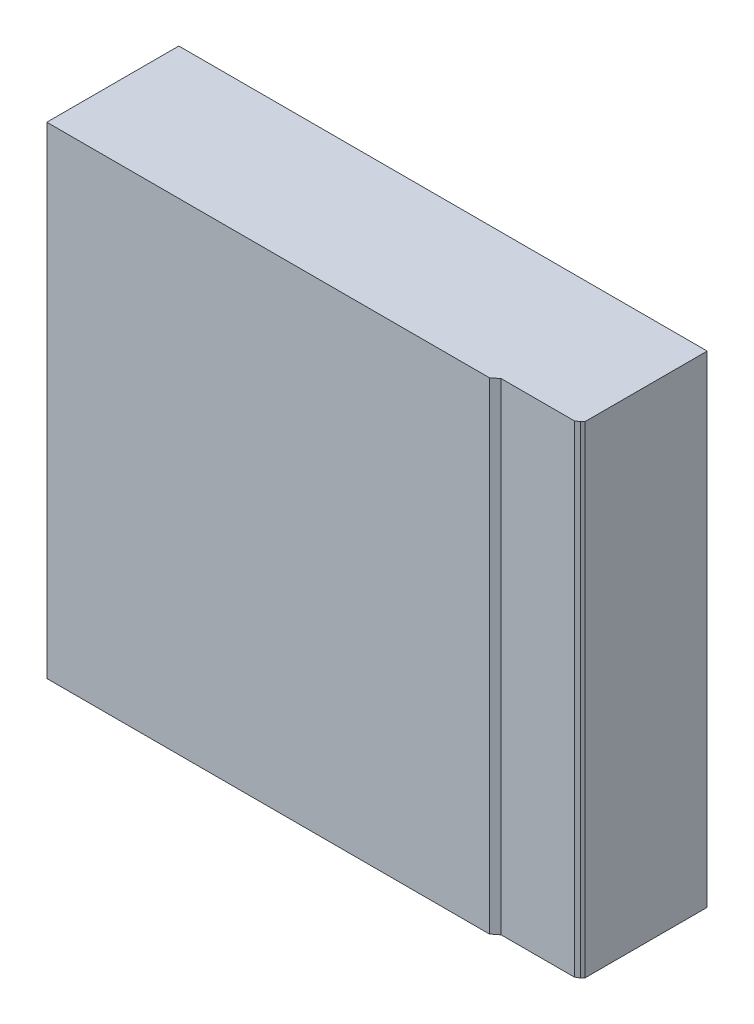
ISO-10303-21;
HEADER;
FILE_DESCRIPTION(('STEP AP214'),'2;1');
FILE_NAME('part.step','',(''),(''),'','','');
FILE_SCHEMA(('AUTOMOTIVE_DESIGN { 1 0 10303 214 1 1 1 1 }'));
ENDSEC;
DATA;
#1=APPLICATION_CONTEXT('core data for automotive mechanical design processes');
#2=APPLICATION_PROTOCOL_DEFINITION('international standard','automotive_design',2000,#1);
#3=PRODUCT_CONTEXT('',#1,'mechanical');
#4=PRODUCT('Part','Part','',(#3));
#5=PRODUCT_RELATED_PRODUCT_CATEGORY('part','',(#4));
#6=PRODUCT_DEFINITION_FORMATION('','',#4);
#7=PRODUCT_DEFINITION_CONTEXT('part definition',#1,'design');
#8=PRODUCT_DEFINITION('design','',#6,#7);
#9=PRODUCT_DEFINITION_SHAPE('','',#8);
#10=(LENGTH_UNIT() NAMED_UNIT(*) SI_UNIT(.MILLI.,.METRE.));
#11=(NAMED_UNIT(*) PLANE_ANGLE_UNIT() SI_UNIT($,.RADIAN.));
#12=(NAMED_UNIT(*) SI_UNIT($,.STERADIAN.) SOLID_ANGLE_UNIT());
#13=UNCERTAINTY_MEASURE_WITH_UNIT(LENGTH_MEASURE(1.E-05),#10,'distance_accuracy_value','');
#14=(GEOMETRIC_REPRESENTATION_CONTEXT(3) GLOBAL_UNCERTAINTY_ASSIGNED_CONTEXT((#13)) GLOBAL_UNIT_ASSIGNED_CONTEXT((#10,
#11,#12)) REPRESENTATION_CONTEXT('',''));
#15=CARTESIAN_POINT('',(0.,0.,0.));
#16=DIRECTION('',(0.,0.,1.));
#17=DIRECTION('',(1.,0.,0.));
#18=AXIS2_PLACEMENT_3D('',#15,#16,#17);
#19=CARTESIAN_POINT('',(0.,730.,-200.));
#20=DIRECTION('',(1.,0.,0.));
#21=DIRECTION('',(0.,0.,-1.));
#22=AXIS2_PLACEMENT_3D('',#19,#20,#21);
#23=PLANE('',#22);
#24=DIRECTION('',(0.,0.,1.));
#25=VECTOR('',#24,1.);
#26=CARTESIAN_POINT('',(0.,0.,-200.));
#27=LINE('',#26,#25);
#28=CARTESIAN_POINT('',(0.,0.,-200.));
#29=VERTEX_POINT('',#28);
#30=CARTESIAN_POINT('',(0.,0.,0.));
#31=VERTEX_POINT('',#30);
#32=EDGE_CURVE('E130',#29,#31,#27,.T.);
#33=ORIENTED_EDGE('',*,*,#32,.T.);
#34=DIRECTION('',(0.,-1.,0.));
#35=VECTOR('',#34,1.);
#36=CARTESIAN_POINT('',(0.,730.,0.));
#37=LINE('',#36,#35);
#38=CARTESIAN_POINT('',(0.,730.,0.));
#39=VERTEX_POINT('',#38);
#40=EDGE_CURVE('E11',#39,#31,#37,.T.);
#41=ORIENTED_EDGE('',*,*,#40,.F.);
#42=DIRECTION('',(0.,0.,1.));
#43=VECTOR('',#42,1.);
#44=CARTESIAN_POINT('',(0.,730.,-200.));
#45=LINE('',#44,#43);
#46=CARTESIAN_POINT('',(0.,730.,-200.));
#47=VERTEX_POINT('',#46);
#48=EDGE_CURVE('E144',#47,#39,#45,.T.);
#49=ORIENTED_EDGE('',*,*,#48,.F.);
#50=DIRECTION('',(0.,-1.,0.));
#51=VECTOR('',#50,1.);
#52=CARTESIAN_POINT('',(0.,730.,-200.));
#53=LINE('',#52,#51);
#54=EDGE_CURVE('E126',#47,#29,#53,.T.);
#55=ORIENTED_EDGE('',*,*,#54,.T.);
#56=EDGE_LOOP('',(#33,#41,#49,#55));
#57=FACE_BOUND('',#56,.T.);
#58=ADVANCED_FACE('F34',(#57),#23,.F.);
#59=CARTESIAN_POINT('',(0.,730.,0.));
#60=DIRECTION('',(0.,0.,-1.));
#61=DIRECTION('',(-1.,0.,0.));
#62=AXIS2_PLACEMENT_3D('',#59,#60,#61);
#63=PLANE('',#62);
#64=DIRECTION('',(1.,0.,0.));
#65=VECTOR('',#64,1.);
#66=CARTESIAN_POINT('',(0.,0.,0.));
#67=LINE('',#66,#65);
#68=CARTESIAN_POINT('',(670.632596603051,0.,0.));
#69=VERTEX_POINT('',#68);
#70=EDGE_CURVE('E133',#31,#69,#67,.T.);
#71=ORIENTED_EDGE('',*,*,#70,.T.);
#72=DIRECTION('',(0.,-1.,0.));
#73=VECTOR('',#72,1.);
#74=CARTESIAN_POINT('',(670.632596603051,730.,0.));
#75=LINE('',#74,#73);
#76=CARTESIAN_POINT('',(670.632596603051,730.,0.));
#77=VERTEX_POINT('',#76);
#78=EDGE_CURVE('E42',#77,#69,#75,.T.);
#79=ORIENTED_EDGE('',*,*,#78,.F.);
#80=DIRECTION('',(1.,0.,0.));
#81=VECTOR('',#80,1.);
#82=CARTESIAN_POINT('',(0.,730.,0.));
#83=LINE('',#82,#81);
#84=EDGE_CURVE('E93',#39,#77,#83,.T.);
#85=ORIENTED_EDGE('',*,*,#84,.F.);
#86=ORIENTED_EDGE('',*,*,#40,.T.);
#87=EDGE_LOOP('',(#71,#79,#85,#86));
#88=FACE_BOUND('',#87,.T.);
#89=ADVANCED_FACE('F179',(#88),#63,.F.);
#90=CARTESIAN_POINT('',(670.632596603051,730.,0.));
#91=DIRECTION('',(-0.61553350325039,0.,-0.788110719617683));
#92=DIRECTION('',(-0.788110719617683,0.,0.61553350325039));
#93=AXIS2_PLACEMENT_3D('',#90,#91,#92);
#94=PLANE('',#93);
#95=DIRECTION('',(0.788110719617683,0.,-0.61553350325039));
#96=VECTOR('',#95,1.);
#97=CARTESIAN_POINT('',(670.632596603051,0.,0.));
#98=LINE('',#97,#96);
#99=CARTESIAN_POINT('',(680.632596603051,0.,-7.81024147912859));
#100=VERTEX_POINT('',#99);
#101=EDGE_CURVE('E135',#69,#100,#98,.T.);
#102=ORIENTED_EDGE('',*,*,#101,.T.);
#103=DIRECTION('',(0.,-1.,0.));
#104=VECTOR('',#103,1.);
#105=CARTESIAN_POINT('',(680.632596603051,730.,-7.81024147912859));
#106=LINE('',#105,#104);
#107=CARTESIAN_POINT('',(680.632596603051,730.,-7.81024147912859));
#108=VERTEX_POINT('',#107);
#109=EDGE_CURVE('E151',#108,#100,#106,.T.);
#110=ORIENTED_EDGE('',*,*,#109,.F.);
#111=DIRECTION('',(0.788110719617683,0.,-0.61553350325039));
#112=VECTOR('',#111,1.);
#113=CARTESIAN_POINT('',(670.632596603051,730.,0.));
#114=LINE('',#113,#112);
#115=EDGE_CURVE('E159',#77,#108,#114,.T.);
#116=ORIENTED_EDGE('',*,*,#115,.F.);
#117=ORIENTED_EDGE('',*,*,#78,.T.);
#118=EDGE_LOOP('',(#102,#110,#116,#117));
#119=FACE_BOUND('',#118,.T.);
#120=ADVANCED_FACE('F157',(#119),#94,.F.);
#121=CARTESIAN_POINT('',(791.427044457084,730.,-7.81024147912859));
#122=DIRECTION('',(0.,0.,-1.));
#123=DIRECTION('',(-1.,0.,0.));
#124=AXIS2_PLACEMENT_3D('',#121,#122,#123);
#125=PLANE('',#124);
#126=DIRECTION('',(1.,0.,0.));
#127=VECTOR('',#126,1.);
#128=CARTESIAN_POINT('',(791.427044457084,0.,-7.81024147912859));
#129=LINE('',#128,#127);
#130=CARTESIAN_POINT('',(791.427044457084,0.,-7.81024147912859));
#131=VERTEX_POINT('',#130);
#132=EDGE_CURVE('E137',#100,#131,#129,.T.);
#133=ORIENTED_EDGE('',*,*,#132,.T.);
#134=DIRECTION('',(0.,-1.,0.));
#135=VECTOR('',#134,1.);
#136=CARTESIAN_POINT('',(791.427044457084,730.,-7.81024147912859));
#137=LINE('',#136,#135);
#138=CARTESIAN_POINT('',(791.427044457084,730.,-7.81024147912859));
#139=VERTEX_POINT('',#138);
#140=EDGE_CURVE('E148',#139,#131,#137,.T.);
#141=ORIENTED_EDGE('',*,*,#140,.F.);
#142=DIRECTION('',(1.,0.,0.));
#143=VECTOR('',#142,1.);
#144=CARTESIAN_POINT('',(791.427044457084,730.,-7.81024147912859));
#145=LINE('',#144,#143);
#146=EDGE_CURVE('E171',#108,#139,#145,.T.);
#147=ORIENTED_EDGE('',*,*,#146,.F.);
#148=ORIENTED_EDGE('',*,*,#109,.T.);
#149=EDGE_LOOP('',(#133,#141,#147,#148));
#150=FACE_BOUND('',#149,.T.);
#151=ADVANCED_FACE('F167',(#150),#125,.F.);
#152=CARTESIAN_POINT('',(791.427044457084,730.,-7.81024147912859));
#153=DIRECTION('',(-0.511532549187665,0.,-0.859263900743869));
#154=DIRECTION('',(-0.859263900743869,0.,0.511532549187665));
#155=AXIS2_PLACEMENT_3D('',#152,#153,#154);
#156=PLANE('',#155);
#157=DIRECTION('',(0.859263900743869,0.,-0.511532549187665));
#158=VECTOR('',#157,1.);
#159=CARTESIAN_POINT('',(791.427044457084,0.,-7.81024147912859));
#160=LINE('',#159,#158);
#161=CARTESIAN_POINT('',(797.288486629254,0.,-11.299644971642));
#162=VERTEX_POINT('',#161);
#163=EDGE_CURVE('E139',#131,#162,#160,.T.);
#164=ORIENTED_EDGE('',*,*,#163,.T.);
#165=DIRECTION('',(0.,-1.,0.));
#166=VECTOR('',#165,1.);
#167=CARTESIAN_POINT('',(797.288486629254,730.,-11.299644971642));
#168=LINE('',#167,#166);
#169=CARTESIAN_POINT('',(797.288486629254,730.,-11.299644971642));
#170=VERTEX_POINT('',#169);
#171=EDGE_CURVE('E121',#170,#162,#168,.T.);
#172=ORIENTED_EDGE('',*,*,#171,.F.);
#173=DIRECTION('',(0.859263900743869,0.,-0.511532549187665));
#174=VECTOR('',#173,1.);
#175=CARTESIAN_POINT('',(791.427044457084,730.,-7.81024147912859));
#176=LINE('',#175,#174);
#177=EDGE_CURVE('E112',#139,#170,#176,.T.);
#178=ORIENTED_EDGE('',*,*,#177,.F.);
#179=ORIENTED_EDGE('',*,*,#140,.T.);
#180=EDGE_LOOP('',(#164,#172,#178,#179));
#181=FACE_BOUND('',#180,.T.);
#182=ADVANCED_FACE('F170',(#181),#156,.F.);
#183=CARTESIAN_POINT('',(797.288486629254,730.,-11.299644971642));
#184=DIRECTION('',(-0.741917728526271,0.,-0.670490927677936));
#185=DIRECTION('',(-0.670490927677936,0.,0.741917728526271));
#186=AXIS2_PLACEMENT_3D('',#183,#184,#185);
#187=PLANE('',#186);
#188=DIRECTION('',(0.670490927677936,0.,-0.741917728526271));
#189=VECTOR('',#188,1.);
#190=CARTESIAN_POINT('',(797.288486629254,0.,-11.299644971642));
#191=LINE('',#190,#189);
#192=CARTESIAN_POINT('',(800.632596603051,0.,-15.));
#193=VERTEX_POINT('',#192);
#194=EDGE_CURVE('E120',#162,#193,#191,.T.);
#195=ORIENTED_EDGE('',*,*,#194,.T.);
#196=DIRECTION('',(0.,-1.,0.));
#197=VECTOR('',#196,1.);
#198=CARTESIAN_POINT('',(800.632596603051,730.,-15.));
#199=LINE('',#198,#197);
#200=CARTESIAN_POINT('',(800.632596603051,730.,-15.));
#201=VERTEX_POINT('',#200);
#202=EDGE_CURVE('E117',#201,#193,#199,.T.);
#203=ORIENTED_EDGE('',*,*,#202,.F.);
#204=DIRECTION('',(0.670490927677936,0.,-0.741917728526271));
#205=VECTOR('',#204,1.);
#206=CARTESIAN_POINT('',(797.288486629254,730.,-11.299644971642));
#207=LINE('',#206,#205);
#208=EDGE_CURVE('E106',#170,#201,#207,.T.);
#209=ORIENTED_EDGE('',*,*,#208,.F.);
#210=ORIENTED_EDGE('',*,*,#171,.T.);
#211=EDGE_LOOP('',(#195,#203,#209,#210));
#212=FACE_BOUND('',#211,.T.);
#213=ADVANCED_FACE('F118',(#212),#187,.F.);
#214=CARTESIAN_POINT('',(800.632596603051,730.,-200.));
#215=DIRECTION('',(-1.,0.,0.));
#216=DIRECTION('',(0.,0.,1.));
#217=AXIS2_PLACEMENT_3D('',#214,#215,#216);
#218=PLANE('',#217);
#219=DIRECTION('',(0.,0.,-1.));
#220=VECTOR('',#219,1.);
#221=CARTESIAN_POINT('',(800.632596603051,0.,-200.));
#222=LINE('',#221,#220);
#223=CARTESIAN_POINT('',(800.632596603051,0.,-200.));
#224=VERTEX_POINT('',#223);
#225=EDGE_CURVE('E79',#193,#224,#222,.T.);
#226=ORIENTED_EDGE('',*,*,#225,.T.);
#227=DIRECTION('',(0.,-1.,0.));
#228=VECTOR('',#227,1.);
#229=CARTESIAN_POINT('',(800.632596603051,730.,-200.));
#230=LINE('',#229,#228);
#231=CARTESIAN_POINT('',(800.632596603051,730.,-200.));
#232=VERTEX_POINT('',#231);
#233=EDGE_CURVE('E122',#232,#224,#230,.T.);
#234=ORIENTED_EDGE('',*,*,#233,.F.);
#235=DIRECTION('',(0.,0.,-1.));
#236=VECTOR('',#235,1.);
#237=CARTESIAN_POINT('',(800.632596603051,730.,-200.));
#238=LINE('',#237,#236);
#239=EDGE_CURVE('E110',#201,#232,#238,.T.);
#240=ORIENTED_EDGE('',*,*,#239,.F.);
#241=ORIENTED_EDGE('',*,*,#202,.T.);
#242=EDGE_LOOP('',(#226,#234,#240,#241));
#243=FACE_BOUND('',#242,.T.);
#244=ADVANCED_FACE('F124',(#243),#218,.F.);
#245=CARTESIAN_POINT('',(0.,730.,-200.));
#246=DIRECTION('',(0.,0.,1.));
#247=DIRECTION('',(1.,0.,0.));
#248=AXIS2_PLACEMENT_3D('',#245,#246,#247);
#249=PLANE('',#248);
#250=DIRECTION('',(-1.,0.,0.));
#251=VECTOR('',#250,1.);
#252=CARTESIAN_POINT('',(0.,0.,-200.));
#253=LINE('',#252,#251);
#254=EDGE_CURVE('E85',#224,#29,#253,.T.);
#255=ORIENTED_EDGE('',*,*,#254,.T.);
#256=ORIENTED_EDGE('',*,*,#54,.F.);
#257=DIRECTION('',(-1.,0.,0.));
#258=VECTOR('',#257,1.);
#259=CARTESIAN_POINT('',(0.,730.,-200.));
#260=LINE('',#259,#258);
#261=EDGE_CURVE('E50',#232,#47,#260,.T.);
#262=ORIENTED_EDGE('',*,*,#261,.F.);
#263=ORIENTED_EDGE('',*,*,#233,.T.);
#264=EDGE_LOOP('',(#255,#256,#262,#263));
#265=FACE_BOUND('',#264,.T.);
#266=ADVANCED_FACE('F195',(#265),#249,.F.);
#267=CARTESIAN_POINT('',(0.,730.,0.));
#268=DIRECTION('',(0.,1.,0.));
#269=DIRECTION('',(0.,0.,1.));
#270=AXIS2_PLACEMENT_3D('',#267,#268,#269);
#271=PLANE('',#270);
#272=ORIENTED_EDGE('',*,*,#48,.T.);
#273=ORIENTED_EDGE('',*,*,#84,.T.);
#274=ORIENTED_EDGE('',*,*,#115,.T.);
#275=ORIENTED_EDGE('',*,*,#146,.T.);
#276=ORIENTED_EDGE('',*,*,#177,.T.);
#277=ORIENTED_EDGE('',*,*,#208,.T.);
#278=ORIENTED_EDGE('',*,*,#239,.T.);
#279=ORIENTED_EDGE('',*,*,#261,.T.);
#280=EDGE_LOOP('',(#272,#273,#274,#275,#276,#277,#278,#279));
#281=FACE_BOUND('',#280,.T.);
#282=ADVANCED_FACE('F108',(#281),#271,.T.);
#283=CARTESIAN_POINT('',(0.,0.,0.));
#284=DIRECTION('',(0.,1.,0.));
#285=DIRECTION('',(0.,0.,1.));
#286=AXIS2_PLACEMENT_3D('',#283,#284,#285);
#287=PLANE('',#286);
#288=ORIENTED_EDGE('',*,*,#32,.F.);
#289=ORIENTED_EDGE('',*,*,#254,.F.);
#290=ORIENTED_EDGE('',*,*,#225,.F.);
#291=ORIENTED_EDGE('',*,*,#194,.F.);
#292=ORIENTED_EDGE('',*,*,#163,.F.);
#293=ORIENTED_EDGE('',*,*,#132,.F.);
#294=ORIENTED_EDGE('',*,*,#101,.F.);
#295=ORIENTED_EDGE('',*,*,#70,.F.);
#296=EDGE_LOOP('',(#288,#289,#290,#291,#292,#293,#294,#295));
#297=FACE_BOUND('',#296,.T.);
#298=ADVANCED_FACE('F163',(#297),#287,.F.);
#299=CLOSED_SHELL('',(#58,#89,#120,#151,#182,#213,#244,#266,#282,#298));
#300=MANIFOLD_SOLID_BREP('B2',#299);
#301=ADVANCED_BREP_SHAPE_REPRESENTATION('',(#18,#300),#14);
#302=SHAPE_DEFINITION_REPRESENTATION(#9,#301);
ENDSEC;
END-ISO-10303-21;
